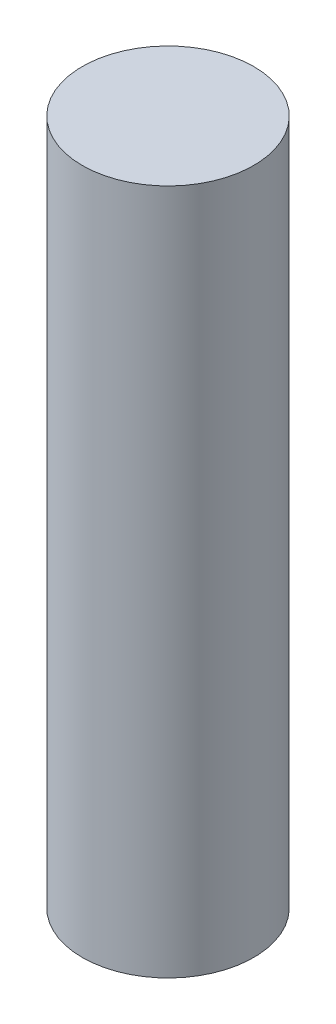
ISO-10303-21;
HEADER;
FILE_DESCRIPTION(('STEP AP214'),'2;1');
FILE_NAME('part.step','',(''),(''),'','','');
FILE_SCHEMA(('AUTOMOTIVE_DESIGN { 1 0 10303 214 1 1 1 1 }'));
ENDSEC;
DATA;
#1=APPLICATION_CONTEXT('core data for automotive mechanical design processes');
#2=APPLICATION_PROTOCOL_DEFINITION('international standard','automotive_design',2000,#1);
#3=PRODUCT_CONTEXT('',#1,'mechanical');
#4=PRODUCT('Part','Part','',(#3));
#5=PRODUCT_RELATED_PRODUCT_CATEGORY('part','',(#4));
#6=PRODUCT_DEFINITION_FORMATION('','',#4);
#7=PRODUCT_DEFINITION_CONTEXT('part definition',#1,'design');
#8=PRODUCT_DEFINITION('design','',#6,#7);
#9=PRODUCT_DEFINITION_SHAPE('','',#8);
#10=(LENGTH_UNIT() NAMED_UNIT(*) SI_UNIT(.MILLI.,.METRE.));
#11=(NAMED_UNIT(*) PLANE_ANGLE_UNIT() SI_UNIT($,.RADIAN.));
#12=(NAMED_UNIT(*) SI_UNIT($,.STERADIAN.) SOLID_ANGLE_UNIT());
#13=UNCERTAINTY_MEASURE_WITH_UNIT(LENGTH_MEASURE(1.E-05),#10,'distance_accuracy_value','');
#14=(GEOMETRIC_REPRESENTATION_CONTEXT(3) GLOBAL_UNCERTAINTY_ASSIGNED_CONTEXT((#13)) GLOBAL_UNIT_ASSIGNED_CONTEXT((#10,
#11,#12)) REPRESENTATION_CONTEXT('',''));
#15=CARTESIAN_POINT('',(0.,0.,0.));
#16=DIRECTION('',(0.,0.,1.));
#17=DIRECTION('',(1.,0.,0.));
#18=AXIS2_PLACEMENT_3D('',#15,#16,#17);
#19=CARTESIAN_POINT('',(0.,25.4,0.));
#20=DIRECTION('',(0.,-1.,0.));
#21=DIRECTION('',(0.,0.,-1.));
#22=AXIS2_PLACEMENT_3D('',#19,#20,#21);
#23=CYLINDRICAL_SURFACE('',#22,3.175);
#24=CARTESIAN_POINT('',(0.,25.4,0.));
#25=DIRECTION('',(0.,1.,0.));
#26=DIRECTION('',(0.,0.,1.));
#27=AXIS2_PLACEMENT_3D('',#24,#25,#26);
#28=CIRCLE('',#27,3.175);
#29=CARTESIAN_POINT('',(0.,25.4,3.175));
#30=VERTEX_POINT('',#29);
#31=EDGE_CURVE('E10',#30,#30,#28,.T.);
#32=ORIENTED_EDGE('',*,*,#31,.F.);
#33=EDGE_LOOP('',(#32));
#34=FACE_BOUND('',#33,.T.);
#35=CARTESIAN_POINT('',(0.,0.,0.));
#36=DIRECTION('',(0.,1.,0.));
#37=DIRECTION('',(0.,0.,1.));
#38=AXIS2_PLACEMENT_3D('',#35,#36,#37);
#39=CIRCLE('',#38,3.175);
#40=CARTESIAN_POINT('',(0.,0.,3.175));
#41=VERTEX_POINT('',#40);
#42=EDGE_CURVE('E34',#41,#41,#39,.T.);
#43=ORIENTED_EDGE('',*,*,#42,.T.);
#44=EDGE_LOOP('',(#43));
#45=FACE_BOUND('',#44,.T.);
#46=ADVANCED_FACE('F31',(#34,#45),#23,.T.);
#47=CARTESIAN_POINT('',(0.,25.4,0.));
#48=DIRECTION('',(0.,1.,0.));
#49=DIRECTION('',(0.,0.,1.));
#50=AXIS2_PLACEMENT_3D('',#47,#48,#49);
#51=PLANE('',#50);
#52=ORIENTED_EDGE('',*,*,#31,.T.);
#53=EDGE_LOOP('',(#52));
#54=FACE_BOUND('',#53,.T.);
#55=ADVANCED_FACE('F46',(#54),#51,.T.);
#56=CARTESIAN_POINT('',(0.,0.,0.));
#57=DIRECTION('',(0.,1.,0.));
#58=DIRECTION('',(0.,0.,1.));
#59=AXIS2_PLACEMENT_3D('',#56,#57,#58);
#60=PLANE('',#59);
#61=ORIENTED_EDGE('',*,*,#42,.F.);
#62=EDGE_LOOP('',(#61));
#63=FACE_BOUND('',#62,.T.);
#64=ADVANCED_FACE('F44',(#63),#60,.F.);
#65=CLOSED_SHELL('',(#46,#55,#64));
#66=MANIFOLD_SOLID_BREP('B2',#65);
#67=ADVANCED_BREP_SHAPE_REPRESENTATION('',(#18,#66),#14);
#68=SHAPE_DEFINITION_REPRESENTATION(#9,#67);
ENDSEC;
END-ISO-10303-21;
